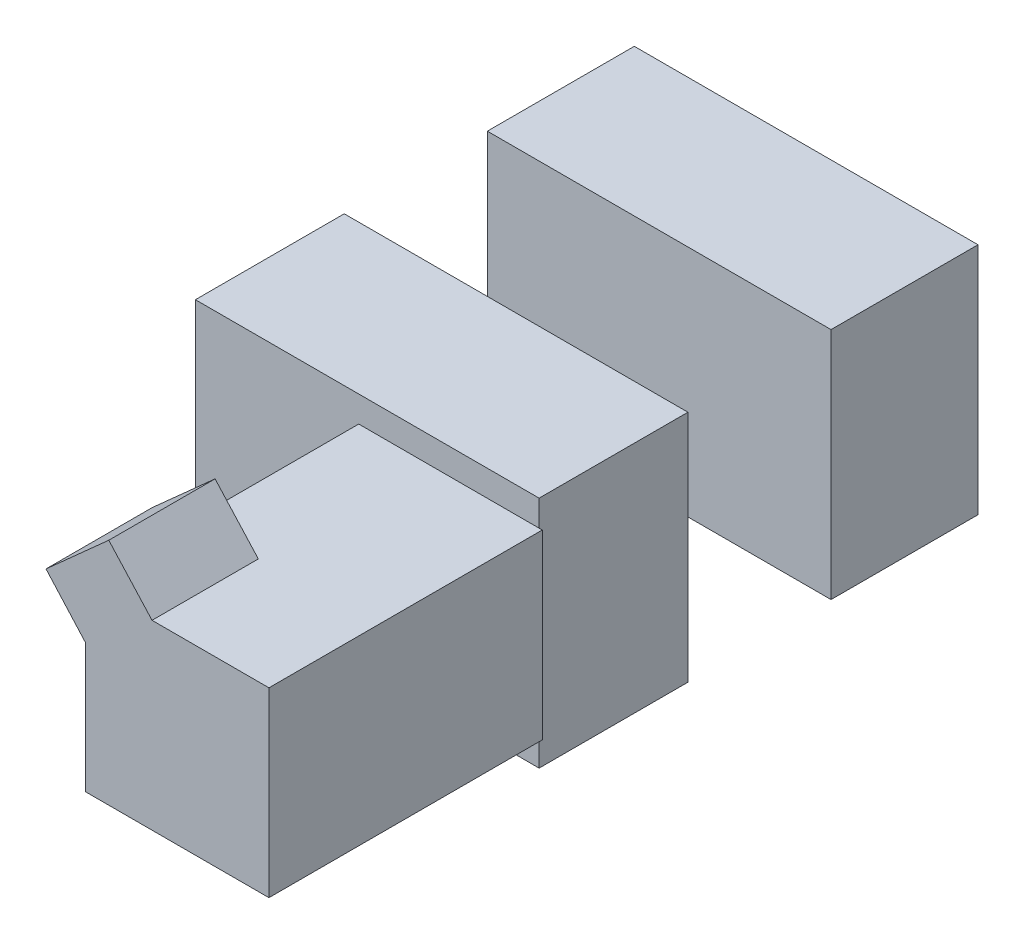
ISO-10303-21;
HEADER;
FILE_DESCRIPTION(('STEP AP214'),'2;1');
FILE_NAME('part.step','',(''),(''),'','','');
FILE_SCHEMA(('AUTOMOTIVE_DESIGN { 1 0 10303 214 1 1 1 1 }'));
ENDSEC;
DATA;
#1=APPLICATION_CONTEXT('core data for automotive mechanical design processes');
#2=APPLICATION_PROTOCOL_DEFINITION('international standard','automotive_design',2000,#1);
#3=PRODUCT_CONTEXT('',#1,'mechanical');
#4=PRODUCT('Part','Part','',(#3));
#5=PRODUCT_RELATED_PRODUCT_CATEGORY('part','',(#4));
#6=PRODUCT_DEFINITION_FORMATION('','',#4);
#7=PRODUCT_DEFINITION_CONTEXT('part definition',#1,'design');
#8=PRODUCT_DEFINITION('design','',#6,#7);
#9=PRODUCT_DEFINITION_SHAPE('','',#8);
#10=(LENGTH_UNIT() NAMED_UNIT(*) SI_UNIT(.MILLI.,.METRE.));
#11=(NAMED_UNIT(*) PLANE_ANGLE_UNIT() SI_UNIT($,.RADIAN.));
#12=(NAMED_UNIT(*) SI_UNIT($,.STERADIAN.) SOLID_ANGLE_UNIT());
#13=UNCERTAINTY_MEASURE_WITH_UNIT(LENGTH_MEASURE(1.E-05),#10,'distance_accuracy_value','');
#14=(GEOMETRIC_REPRESENTATION_CONTEXT(3) GLOBAL_UNCERTAINTY_ASSIGNED_CONTEXT((#13)) GLOBAL_UNIT_ASSIGNED_CONTEXT((#10,
#11,#12)) REPRESENTATION_CONTEXT('',''));
#15=CARTESIAN_POINT('',(0.,0.,0.));
#16=DIRECTION('',(0.,0.,1.));
#17=DIRECTION('',(1.,0.,0.));
#18=AXIS2_PLACEMENT_3D('',#15,#16,#17);
#19=CARTESIAN_POINT('',(0.0291843141343055,0.0385,0.0724133068580298));
#20=DIRECTION('',(0.,0.,-1.));
#21=DIRECTION('',(-1.,0.,0.));
#22=AXIS2_PLACEMENT_3D('',#19,#20,#21);
#23=PLANE('',#22);
#24=DIRECTION('',(1.,0.,0.));
#25=VECTOR('',#24,1.);
#26=CARTESIAN_POINT('',(-0.0302175356821504,-0.0299286581575871,0.0724133068580298));
#27=LINE('',#26,#25);
#28=CARTESIAN_POINT('',(-0.0302175356821504,-0.0299286581575871,0.0724133068580298));
#29=VERTEX_POINT('',#28);
#30=CARTESIAN_POINT('',(0.0291843141343055,-0.0299286581575871,0.0724133068580298));
#31=VERTEX_POINT('',#30);
#32=EDGE_CURVE('E74',#29,#31,#27,.T.);
#33=ORIENTED_EDGE('',*,*,#32,.F.);
#34=DIRECTION('',(0.,-1.,0.));
#35=VECTOR('',#34,1.);
#36=CARTESIAN_POINT('',(-0.0302175356821504,-0.0299286581575871,0.0724133068580298));
#37=LINE('',#36,#35);
#38=CARTESIAN_POINT('',(-0.0302175356821504,0.0299286581575871,0.0724133068580298));
#39=VERTEX_POINT('',#38);
#40=EDGE_CURVE('E200',#39,#29,#37,.T.);
#41=ORIENTED_EDGE('',*,*,#40,.F.);
#42=DIRECTION('',(-1.,0.,0.));
#43=VECTOR('',#42,1.);
#44=CARTESIAN_POINT('',(-0.0302175356821504,0.0299286581575871,0.0724133068580298));
#45=LINE('',#44,#43);
#46=CARTESIAN_POINT('',(0.0291843141343055,0.0299286581575871,0.0724133068580298));
#47=VERTEX_POINT('',#46);
#48=EDGE_CURVE('E59',#47,#39,#45,.T.);
#49=ORIENTED_EDGE('',*,*,#48,.F.);
#50=DIRECTION('',(0.,-1.,0.));
#51=VECTOR('',#50,1.);
#52=CARTESIAN_POINT('',(0.0291843141343055,0.0385,0.0724133068580298));
#53=LINE('',#52,#51);
#54=CARTESIAN_POINT('',(0.0291843141343055,0.0385,0.0724133068580298));
#55=VERTEX_POINT('',#54);
#56=EDGE_CURVE('E224',#55,#47,#53,.T.);
#57=ORIENTED_EDGE('',*,*,#56,.F.);
#58=DIRECTION('',(1.,0.,0.));
#59=VECTOR('',#58,1.);
#60=CARTESIAN_POINT('',(0.0291843141343055,0.0385,0.0724133068580298));
#61=LINE('',#60,#59);
#62=CARTESIAN_POINT('',(-0.083993136882782,0.0385,0.0724133068580298));
#63=VERTEX_POINT('',#62);
#64=EDGE_CURVE('E227',#63,#55,#61,.T.);
#65=ORIENTED_EDGE('',*,*,#64,.F.);
#66=DIRECTION('',(0.,-1.,0.));
#67=VECTOR('',#66,1.);
#68=CARTESIAN_POINT('',(-0.083993136882782,0.0385,0.0724133068580298));
#69=LINE('',#68,#67);
#70=CARTESIAN_POINT('',(-0.083993136882782,-0.0385,0.0724133068580298));
#71=VERTEX_POINT('',#70);
#72=EDGE_CURVE('E220',#63,#71,#69,.T.);
#73=ORIENTED_EDGE('',*,*,#72,.T.);
#74=DIRECTION('',(1.,0.,0.));
#75=VECTOR('',#74,1.);
#76=CARTESIAN_POINT('',(0.0291843141343055,-0.0385,0.0724133068580298));
#77=LINE('',#76,#75);
#78=CARTESIAN_POINT('',(0.0291843141343055,-0.0385,0.0724133068580298));
#79=VERTEX_POINT('',#78);
#80=EDGE_CURVE('E229',#71,#79,#77,.T.);
#81=ORIENTED_EDGE('',*,*,#80,.T.);
#82=EDGE_CURVE('E223',#31,#79,#53,.T.);
#83=ORIENTED_EDGE('',*,*,#82,.F.);
#84=EDGE_LOOP('',(#33,#41,#49,#57,#65,#73,#81,#83));
#85=FACE_BOUND('',#84,.T.);
#86=ADVANCED_FACE('F51',(#85),#23,.F.);
#87=CARTESIAN_POINT('',(0.0291843141343055,0.0385,0.0724133068580298));
#88=DIRECTION('',(-1.,0.,0.));
#89=DIRECTION('',(0.,0.,1.));
#90=AXIS2_PLACEMENT_3D('',#87,#88,#89);
#91=PLANE('',#90);
#92=DIRECTION('',(0.,0.,-1.));
#93=VECTOR('',#92,1.);
#94=CARTESIAN_POINT('',(0.0291843141343055,-0.0385,0.0724133068580298));
#95=LINE('',#94,#93);
#96=CARTESIAN_POINT('',(0.0291843141343055,-0.0385,0.0234103265722403));
#97=VERTEX_POINT('',#96);
#98=EDGE_CURVE('E237',#79,#97,#95,.T.);
#99=ORIENTED_EDGE('',*,*,#98,.T.);
#100=DIRECTION('',(0.,-1.,0.));
#101=VECTOR('',#100,1.);
#102=CARTESIAN_POINT('',(0.0291843141343055,0.0385,0.0234103265722403));
#103=LINE('',#102,#101);
#104=CARTESIAN_POINT('',(0.0291843141343055,0.0385,0.0234103265722403));
#105=VERTEX_POINT('',#104);
#106=EDGE_CURVE('E214',#105,#97,#103,.T.);
#107=ORIENTED_EDGE('',*,*,#106,.F.);
#108=DIRECTION('',(0.,0.,-1.));
#109=VECTOR('',#108,1.);
#110=CARTESIAN_POINT('',(0.0291843141343055,0.0385,0.0724133068580298));
#111=LINE('',#110,#109);
#112=EDGE_CURVE('E233',#55,#105,#111,.T.);
#113=ORIENTED_EDGE('',*,*,#112,.F.);
#114=ORIENTED_EDGE('',*,*,#56,.T.);
#115=EDGE_CURVE('E228',#47,#31,#53,.T.);
#116=ORIENTED_EDGE('',*,*,#115,.T.);
#117=ORIENTED_EDGE('',*,*,#82,.T.);
#118=EDGE_LOOP('',(#99,#107,#113,#114,#116,#117));
#119=FACE_BOUND('',#118,.T.);
#120=ADVANCED_FACE('F252',(#119),#91,.F.);
#121=CARTESIAN_POINT('',(0.0291843141343055,0.0385,0.0234103265722403));
#122=DIRECTION('',(0.,0.,1.));
#123=DIRECTION('',(1.,0.,0.));
#124=AXIS2_PLACEMENT_3D('',#121,#122,#123);
#125=PLANE('',#124);
#126=DIRECTION('',(-1.,0.,0.));
#127=VECTOR('',#126,1.);
#128=CARTESIAN_POINT('',(0.0291843141343055,-0.0385,0.0234103265722403));
#129=LINE('',#128,#127);
#130=CARTESIAN_POINT('',(-0.083993136882782,-0.0385,0.0234103265722403));
#131=VERTEX_POINT('',#130);
#132=EDGE_CURVE('E235',#97,#131,#129,.T.);
#133=ORIENTED_EDGE('',*,*,#132,.T.);
#134=DIRECTION('',(0.,-1.,0.));
#135=VECTOR('',#134,1.);
#136=CARTESIAN_POINT('',(-0.083993136882782,0.0385,0.0234103265722403));
#137=LINE('',#136,#135);
#138=CARTESIAN_POINT('',(-0.083993136882782,0.0385,0.0234103265722403));
#139=VERTEX_POINT('',#138);
#140=EDGE_CURVE('E217',#139,#131,#137,.T.);
#141=ORIENTED_EDGE('',*,*,#140,.F.);
#142=DIRECTION('',(-1.,0.,0.));
#143=VECTOR('',#142,1.);
#144=CARTESIAN_POINT('',(0.0291843141343055,0.0385,0.0234103265722403));
#145=LINE('',#144,#143);
#146=EDGE_CURVE('E243',#105,#139,#145,.T.);
#147=ORIENTED_EDGE('',*,*,#146,.F.);
#148=ORIENTED_EDGE('',*,*,#106,.T.);
#149=EDGE_LOOP('',(#133,#141,#147,#148));
#150=FACE_BOUND('',#149,.T.);
#151=ADVANCED_FACE('F255',(#150),#125,.F.);
#152=CARTESIAN_POINT('',(-0.083993136882782,0.0385,0.0724133068580298));
#153=DIRECTION('',(1.,0.,0.));
#154=DIRECTION('',(0.,0.,-1.));
#155=AXIS2_PLACEMENT_3D('',#152,#153,#154);
#156=PLANE('',#155);
#157=DIRECTION('',(0.,0.,1.));
#158=VECTOR('',#157,1.);
#159=CARTESIAN_POINT('',(-0.083993136882782,-0.0385,0.0724133068580298));
#160=LINE('',#159,#158);
#161=EDGE_CURVE('E232',#131,#71,#160,.T.);
#162=ORIENTED_EDGE('',*,*,#161,.T.);
#163=ORIENTED_EDGE('',*,*,#72,.F.);
#164=DIRECTION('',(0.,0.,1.));
#165=VECTOR('',#164,1.);
#166=CARTESIAN_POINT('',(-0.083993136882782,0.0385,0.0724133068580298));
#167=LINE('',#166,#165);
#168=EDGE_CURVE('E241',#139,#63,#167,.T.);
#169=ORIENTED_EDGE('',*,*,#168,.F.);
#170=ORIENTED_EDGE('',*,*,#140,.T.);
#171=EDGE_LOOP('',(#162,#163,#169,#170));
#172=FACE_BOUND('',#171,.T.);
#173=ADVANCED_FACE('F260',(#172),#156,.F.);
#174=CARTESIAN_POINT('',(0.,0.0385,0.));
#175=DIRECTION('',(0.,1.,0.));
#176=DIRECTION('',(0.,0.,1.));
#177=AXIS2_PLACEMENT_3D('',#174,#175,#176);
#178=PLANE('',#177);
#179=ORIENTED_EDGE('',*,*,#112,.T.);
#180=ORIENTED_EDGE('',*,*,#146,.T.);
#181=ORIENTED_EDGE('',*,*,#168,.T.);
#182=ORIENTED_EDGE('',*,*,#64,.T.);
#183=EDGE_LOOP('',(#179,#180,#181,#182));
#184=FACE_BOUND('',#183,.T.);
#185=ADVANCED_FACE('F53',(#184),#178,.T.);
#186=CARTESIAN_POINT('',(0.,-0.0385,0.));
#187=DIRECTION('',(0.,1.,0.));
#188=DIRECTION('',(0.,0.,1.));
#189=AXIS2_PLACEMENT_3D('',#186,#187,#188);
#190=PLANE('',#189);
#191=ORIENTED_EDGE('',*,*,#98,.F.);
#192=ORIENTED_EDGE('',*,*,#80,.F.);
#193=ORIENTED_EDGE('',*,*,#161,.F.);
#194=ORIENTED_EDGE('',*,*,#132,.F.);
#195=EDGE_LOOP('',(#191,#192,#193,#194));
#196=FACE_BOUND('',#195,.T.);
#197=ADVANCED_FACE('F306',(#196),#190,.F.);
#198=CARTESIAN_POINT('',(0.,0.,0.0724133068580298));
#199=DIRECTION('',(0.,0.,-1.));
#200=DIRECTION('',(-1.,0.,0.));
#201=AXIS2_PLACEMENT_3D('',#198,#199,#200);
#202=PLANE('',#201);
#203=ORIENTED_EDGE('',*,*,#115,.F.);
#204=CARTESIAN_POINT('',(0.0302175356821504,0.0299286581575871,0.0724133068580298));
#205=VERTEX_POINT('',#204);
#206=EDGE_CURVE('E197',#205,#47,#45,.T.);
#207=ORIENTED_EDGE('',*,*,#206,.F.);
#208=DIRECTION('',(0.,1.,0.));
#209=VECTOR('',#208,1.);
#210=CARTESIAN_POINT('',(0.0302175356821504,-0.0299286581575871,0.0724133068580298));
#211=LINE('',#210,#209);
#212=CARTESIAN_POINT('',(0.0302175356821504,-0.0299286581575871,0.0724133068580298));
#213=VERTEX_POINT('',#212);
#214=EDGE_CURVE('E183',#213,#205,#211,.T.);
#215=ORIENTED_EDGE('',*,*,#214,.F.);
#216=EDGE_CURVE('E202',#31,#213,#27,.T.);
#217=ORIENTED_EDGE('',*,*,#216,.F.);
#218=EDGE_LOOP('',(#203,#207,#215,#217));
#219=FACE_BOUND('',#218,.T.);
#220=ADVANCED_FACE('F267',(#219),#202,.T.);
#221=CARTESIAN_POINT('',(0.0302175356821504,-0.0299286581575871,0.16241330685803));
#222=DIRECTION('',(-1.,0.,0.));
#223=DIRECTION('',(0.,0.,1.));
#224=AXIS2_PLACEMENT_3D('',#221,#222,#223);
#225=PLANE('',#224);
#226=ORIENTED_EDGE('',*,*,#214,.T.);
#227=DIRECTION('',(0.,0.,-1.));
#228=VECTOR('',#227,1.);
#229=CARTESIAN_POINT('',(0.0302175356821504,0.0299286581575871,0.16241330685803));
#230=LINE('',#229,#228);
#231=CARTESIAN_POINT('',(0.0302175356821504,0.0299286581575871,0.16241330685803));
#232=VERTEX_POINT('',#231);
#233=EDGE_CURVE('E211',#232,#205,#230,.T.);
#234=ORIENTED_EDGE('',*,*,#233,.F.);
#235=DIRECTION('',(0.,1.,0.));
#236=VECTOR('',#235,1.);
#237=CARTESIAN_POINT('',(0.0302175356821504,-0.0299286581575871,0.16241330685803));
#238=LINE('',#237,#236);
#239=CARTESIAN_POINT('',(0.0302175356821504,-0.0299286581575871,0.16241330685803));
#240=VERTEX_POINT('',#239);
#241=EDGE_CURVE('E184',#240,#232,#238,.T.);
#242=ORIENTED_EDGE('',*,*,#241,.F.);
#243=DIRECTION('',(0.,0.,-1.));
#244=VECTOR('',#243,1.);
#245=CARTESIAN_POINT('',(0.0302175356821504,-0.0299286581575871,0.16241330685803));
#246=LINE('',#245,#244);
#247=EDGE_CURVE('E194',#240,#213,#246,.T.);
#248=ORIENTED_EDGE('',*,*,#247,.T.);
#249=EDGE_LOOP('',(#226,#234,#242,#248));
#250=FACE_BOUND('',#249,.T.);
#251=ADVANCED_FACE('F275',(#250),#225,.F.);
#252=CARTESIAN_POINT('',(-0.0302175356821504,0.0299286581575871,0.16241330685803));
#253=DIRECTION('',(0.,-1.,0.));
#254=DIRECTION('',(0.,0.,-1.));
#255=AXIS2_PLACEMENT_3D('',#252,#253,#254);
#256=PLANE('',#255);
#257=DIRECTION('',(1.,0.,0.));
#258=VECTOR('',#257,1.);
#259=CARTESIAN_POINT('',(-0.0302175356821504,0.0299286581575871,0.12741330685803));
#260=LINE('',#259,#258);
#261=CARTESIAN_POINT('',(-0.0302175356821504,0.0299286581575871,0.12741330685803));
#262=VERTEX_POINT('',#261);
#263=CARTESIAN_POINT('',(-0.00827703686071198,0.0299286581575871,0.12741330685803));
#264=VERTEX_POINT('',#263);
#265=EDGE_CURVE('E181',#262,#264,#260,.T.);
#266=ORIENTED_EDGE('',*,*,#265,.T.);
#267=DIRECTION('',(0.,0.,1.));
#268=VECTOR('',#267,1.);
#269=CARTESIAN_POINT('',(-0.00827703686071198,0.0299286581575871,0.16241330685803));
#270=LINE('',#269,#268);
#271=CARTESIAN_POINT('',(-0.00827703686071198,0.0299286581575871,0.16241330685803));
#272=VERTEX_POINT('',#271);
#273=EDGE_CURVE('E154',#264,#272,#270,.T.);
#274=ORIENTED_EDGE('',*,*,#273,.T.);
#275=DIRECTION('',(-1.,0.,0.));
#276=VECTOR('',#275,1.);
#277=CARTESIAN_POINT('',(-0.0302175356821504,0.0299286581575871,0.16241330685803));
#278=LINE('',#277,#276);
#279=EDGE_CURVE('E187',#232,#272,#278,.T.);
#280=ORIENTED_EDGE('',*,*,#279,.F.);
#281=ORIENTED_EDGE('',*,*,#233,.T.);
#282=ORIENTED_EDGE('',*,*,#206,.T.);
#283=ORIENTED_EDGE('',*,*,#48,.T.);
#284=DIRECTION('',(0.,0.,-1.));
#285=VECTOR('',#284,1.);
#286=CARTESIAN_POINT('',(-0.0302175356821504,0.0299286581575871,0.16241330685803));
#287=LINE('',#286,#285);
#288=EDGE_CURVE('E209',#262,#39,#287,.T.);
#289=ORIENTED_EDGE('',*,*,#288,.F.);
#290=EDGE_LOOP('',(#266,#274,#280,#281,#282,#283,#289));
#291=FACE_BOUND('',#290,.T.);
#292=ADVANCED_FACE('F270',(#291),#256,.F.);
#293=CARTESIAN_POINT('',(-0.0302175356821504,-0.0299286581575871,0.16241330685803));
#294=DIRECTION('',(1.,0.,0.));
#295=DIRECTION('',(0.,0.,-1.));
#296=AXIS2_PLACEMENT_3D('',#293,#294,#295);
#297=PLANE('',#296);
#298=DIRECTION('',(0.,-1.,0.));
#299=VECTOR('',#298,1.);
#300=CARTESIAN_POINT('',(-0.0302175356821504,-0.0299286581575871,0.16241330685803));
#301=LINE('',#300,#299);
#302=CARTESIAN_POINT('',(-0.0302175356821504,0.0126365309997264,0.16241330685803));
#303=VERTEX_POINT('',#302);
#304=CARTESIAN_POINT('',(-0.0302175356821504,-0.0299286581575871,0.16241330685803));
#305=VERTEX_POINT('',#304);
#306=EDGE_CURVE('E190',#303,#305,#301,.T.);
#307=ORIENTED_EDGE('',*,*,#306,.F.);
#308=DIRECTION('',(0.,0.,1.));
#309=VECTOR('',#308,1.);
#310=CARTESIAN_POINT('',(-0.0302175356821504,0.0126365309997264,0.12741330685803));
#311=LINE('',#310,#309);
#312=CARTESIAN_POINT('',(-0.0302175356821504,0.0126365309997264,0.12741330685803));
#313=VERTEX_POINT('',#312);
#314=EDGE_CURVE('E177',#313,#303,#311,.T.);
#315=ORIENTED_EDGE('',*,*,#314,.F.);
#316=DIRECTION('',(0.,1.,0.));
#317=VECTOR('',#316,1.);
#318=CARTESIAN_POINT('',(-0.0302175356821504,-0.0299286581575871,0.12741330685803));
#319=LINE('',#318,#317);
#320=EDGE_CURVE('E12',#313,#262,#319,.T.);
#321=ORIENTED_EDGE('',*,*,#320,.T.);
#322=ORIENTED_EDGE('',*,*,#288,.T.);
#323=ORIENTED_EDGE('',*,*,#40,.T.);
#324=DIRECTION('',(0.,0.,-1.));
#325=VECTOR('',#324,1.);
#326=CARTESIAN_POINT('',(-0.0302175356821504,-0.0299286581575871,0.16241330685803));
#327=LINE('',#326,#325);
#328=EDGE_CURVE('E206',#305,#29,#327,.T.);
#329=ORIENTED_EDGE('',*,*,#328,.F.);
#330=EDGE_LOOP('',(#307,#315,#321,#322,#323,#329));
#331=FACE_BOUND('',#330,.T.);
#332=ADVANCED_FACE('F283',(#331),#297,.F.);
#333=CARTESIAN_POINT('',(-0.0302175356821504,-0.0299286581575871,0.16241330685803));
#334=DIRECTION('',(0.,1.,0.));
#335=DIRECTION('',(0.,0.,1.));
#336=AXIS2_PLACEMENT_3D('',#333,#334,#335);
#337=PLANE('',#336);
#338=ORIENTED_EDGE('',*,*,#32,.T.);
#339=ORIENTED_EDGE('',*,*,#216,.T.);
#340=ORIENTED_EDGE('',*,*,#247,.F.);
#341=DIRECTION('',(1.,0.,0.));
#342=VECTOR('',#341,1.);
#343=CARTESIAN_POINT('',(-0.0302175356821504,-0.0299286581575871,0.16241330685803));
#344=LINE('',#343,#342);
#345=EDGE_CURVE('E192',#305,#240,#344,.T.);
#346=ORIENTED_EDGE('',*,*,#345,.F.);
#347=ORIENTED_EDGE('',*,*,#328,.T.);
#348=EDGE_LOOP('',(#338,#339,#340,#346,#347));
#349=FACE_BOUND('',#348,.T.);
#350=ADVANCED_FACE('F279',(#349),#337,.F.);
#351=CARTESIAN_POINT('',(0.,0.,0.16241330685803));
#352=DIRECTION('',(0.,0.,-1.));
#353=DIRECTION('',(-1.,0.,0.));
#354=AXIS2_PLACEMENT_3D('',#351,#352,#353);
#355=PLANE('',#354);
#356=ORIENTED_EDGE('',*,*,#279,.T.);
#357=DIRECTION('',(-0.671637135183694,0.740880259314716,0.));
#358=VECTOR('',#357,1.);
#359=CARTESIAN_POINT('',(-0.0225220918268375,0.0456423217780016,0.16241330685803));
#360=LINE('',#359,#358);
#361=CARTESIAN_POINT('',(-0.0225220918268375,0.0456423217780016,0.16241330685803));
#362=VERTEX_POINT('',#361);
#363=EDGE_CURVE('E173',#272,#362,#360,.T.);
#364=ORIENTED_EDGE('',*,*,#363,.T.);
#365=DIRECTION('',(-0.7449244789865,-0.667148799449337,0.));
#366=VECTOR('',#365,1.);
#367=CARTESIAN_POINT('',(-0.0431954581019835,0.0271274093538523,0.16241330685803));
#368=LINE('',#367,#366);
#369=CARTESIAN_POINT('',(-0.0431954581019835,0.0271274093538523,0.16241330685803));
#370=VERTEX_POINT('',#369);
#371=EDGE_CURVE('E164',#362,#370,#368,.T.);
#372=ORIENTED_EDGE('',*,*,#371,.T.);
#373=DIRECTION('',(0.667148799449337,-0.7449244789865,0.));
#374=VECTOR('',#373,1.);
#375=CARTESIAN_POINT('',(-0.0302175356821504,0.0126365309997264,0.16241330685803));
#376=LINE('',#375,#374);
#377=EDGE_CURVE('E66',#370,#303,#376,.T.);
#378=ORIENTED_EDGE('',*,*,#377,.T.);
#379=ORIENTED_EDGE('',*,*,#306,.T.);
#380=ORIENTED_EDGE('',*,*,#345,.T.);
#381=ORIENTED_EDGE('',*,*,#241,.T.);
#382=EDGE_LOOP('',(#356,#364,#372,#378,#379,#380,#381));
#383=FACE_BOUND('',#382,.T.);
#384=ADVANCED_FACE('F287',(#383),#355,.F.);
#385=CARTESIAN_POINT('',(0.,0.,0.12741330685803));
#386=DIRECTION('',(0.,0.,-1.));
#387=DIRECTION('',(-1.,0.,0.));
#388=AXIS2_PLACEMENT_3D('',#385,#386,#387);
#389=PLANE('',#388);
#390=ORIENTED_EDGE('',*,*,#265,.F.);
#391=ORIENTED_EDGE('',*,*,#320,.F.);
#392=DIRECTION('',(0.667148799449337,-0.7449244789865,0.));
#393=VECTOR('',#392,1.);
#394=CARTESIAN_POINT('',(-0.0302175356821504,0.0126365309997264,0.12741330685803));
#395=LINE('',#394,#393);
#396=CARTESIAN_POINT('',(-0.0431954581019835,0.0271274093538523,0.12741330685803));
#397=VERTEX_POINT('',#396);
#398=EDGE_CURVE('E166',#397,#313,#395,.T.);
#399=ORIENTED_EDGE('',*,*,#398,.F.);
#400=DIRECTION('',(-0.7449244789865,-0.667148799449337,0.));
#401=VECTOR('',#400,1.);
#402=CARTESIAN_POINT('',(-0.0431954581019835,0.0271274093538523,0.12741330685803));
#403=LINE('',#402,#401);
#404=CARTESIAN_POINT('',(-0.0225220918268375,0.0456423217780016,0.12741330685803));
#405=VERTEX_POINT('',#404);
#406=EDGE_CURVE('E158',#405,#397,#403,.T.);
#407=ORIENTED_EDGE('',*,*,#406,.F.);
#408=DIRECTION('',(-0.671637135183694,0.740880259314716,0.));
#409=VECTOR('',#408,1.);
#410=CARTESIAN_POINT('',(-0.0225220918268375,0.0456423217780016,0.12741330685803));
#411=LINE('',#410,#409);
#412=EDGE_CURVE('E148',#264,#405,#411,.T.);
#413=ORIENTED_EDGE('',*,*,#412,.F.);
#414=EDGE_LOOP('',(#390,#391,#399,#407,#413));
#415=FACE_BOUND('',#414,.T.);
#416=ADVANCED_FACE('F168',(#415),#389,.T.);
#417=CARTESIAN_POINT('',(-0.0225220918268375,0.0456423217780016,0.12741330685803));
#418=DIRECTION('',(0.740880259314716,0.671637135183694,0.));
#419=DIRECTION('',(-0.671637135183694,0.740880259314716,0.));
#420=AXIS2_PLACEMENT_3D('',#417,#418,#419);
#421=PLANE('',#420);
#422=ORIENTED_EDGE('',*,*,#273,.F.);
#423=ORIENTED_EDGE('',*,*,#412,.T.);
#424=DIRECTION('',(0.,0.,1.));
#425=VECTOR('',#424,1.);
#426=CARTESIAN_POINT('',(-0.0225220918268375,0.0456423217780016,0.12741330685803));
#427=LINE('',#426,#425);
#428=EDGE_CURVE('E151',#405,#362,#427,.T.);
#429=ORIENTED_EDGE('',*,*,#428,.T.);
#430=ORIENTED_EDGE('',*,*,#363,.F.);
#431=EDGE_LOOP('',(#422,#423,#429,#430));
#432=FACE_BOUND('',#431,.T.);
#433=ADVANCED_FACE('F150',(#432),#421,.T.);
#434=CARTESIAN_POINT('',(-0.0302175356821504,0.0126365309997264,0.12741330685803));
#435=DIRECTION('',(-0.7449244789865,-0.667148799449337,0.));
#436=DIRECTION('',(0.667148799449337,-0.7449244789865,0.));
#437=AXIS2_PLACEMENT_3D('',#434,#435,#436);
#438=PLANE('',#437);
#439=ORIENTED_EDGE('',*,*,#377,.F.);
#440=DIRECTION('',(0.,0.,1.));
#441=VECTOR('',#440,1.);
#442=CARTESIAN_POINT('',(-0.0431954581019835,0.0271274093538523,0.12741330685803));
#443=LINE('',#442,#441);
#444=EDGE_CURVE('E165',#397,#370,#443,.T.);
#445=ORIENTED_EDGE('',*,*,#444,.F.);
#446=ORIENTED_EDGE('',*,*,#398,.T.);
#447=ORIENTED_EDGE('',*,*,#314,.T.);
#448=EDGE_LOOP('',(#439,#445,#446,#447));
#449=FACE_BOUND('',#448,.T.);
#450=ADVANCED_FACE('F286',(#449),#438,.T.);
#451=CARTESIAN_POINT('',(-0.0431954581019835,0.0271274093538523,0.12741330685803));
#452=DIRECTION('',(-0.667148799449337,0.7449244789865,0.));
#453=DIRECTION('',(-0.7449244789865,-0.667148799449337,0.));
#454=AXIS2_PLACEMENT_3D('',#451,#452,#453);
#455=PLANE('',#454);
#456=ORIENTED_EDGE('',*,*,#371,.F.);
#457=ORIENTED_EDGE('',*,*,#428,.F.);
#458=ORIENTED_EDGE('',*,*,#406,.T.);
#459=ORIENTED_EDGE('',*,*,#444,.T.);
#460=EDGE_LOOP('',(#456,#457,#458,#459));
#461=FACE_BOUND('',#460,.T.);
#462=ADVANCED_FACE('F162',(#461),#455,.T.);
#463=CLOSED_SHELL('',(#86,#120,#151,#173,#185,#197,#220,#251,#292,#332,#350,#384,#416,#433,#450,#462));
#464=MANIFOLD_SOLID_BREP('B2',#463);
#465=CARTESIAN_POINT('',(-0.083993136882782,0.0385,-0.0721080005168915));
#466=DIRECTION('',(1.,0.,0.));
#467=DIRECTION('',(0.,0.,-1.));
#468=AXIS2_PLACEMENT_3D('',#465,#466,#467);
#469=PLANE('',#468);
#470=DIRECTION('',(0.,0.,1.));
#471=VECTOR('',#470,1.);
#472=CARTESIAN_POINT('',(-0.083993136882782,-0.0385,-0.0721080005168915));
#473=LINE('',#472,#471);
#474=CARTESIAN_POINT('',(-0.083993136882782,-0.0385,-0.0721080005168915));
#475=VERTEX_POINT('',#474);
#476=CARTESIAN_POINT('',(-0.083993136882782,-0.0385,-0.0237159438302637));
#477=VERTEX_POINT('',#476);
#478=EDGE_CURVE('E517',#475,#477,#473,.T.);
#479=ORIENTED_EDGE('',*,*,#478,.T.);
#480=DIRECTION('',(0.,-1.,0.));
#481=VECTOR('',#480,1.);
#482=CARTESIAN_POINT('',(-0.083993136882782,0.0385,-0.0237159438302637));
#483=LINE('',#482,#481);
#484=CARTESIAN_POINT('',(-0.083993136882782,0.0385,-0.0237159438302637));
#485=VERTEX_POINT('',#484);
#486=EDGE_CURVE('E49',#485,#477,#483,.T.);
#487=ORIENTED_EDGE('',*,*,#486,.F.);
#488=DIRECTION('',(0.,0.,1.));
#489=VECTOR('',#488,1.);
#490=CARTESIAN_POINT('',(-0.083993136882782,0.0385,-0.0721080005168915));
#491=LINE('',#490,#489);
#492=CARTESIAN_POINT('',(-0.083993136882782,0.0385,-0.0721080005168915));
#493=VERTEX_POINT('',#492);
#494=EDGE_CURVE('E505',#493,#485,#491,.T.);
#495=ORIENTED_EDGE('',*,*,#494,.F.);
#496=DIRECTION('',(0.,-1.,0.));
#497=VECTOR('',#496,1.);
#498=CARTESIAN_POINT('',(-0.083993136882782,0.0385,-0.0721080005168915));
#499=LINE('',#498,#497);
#500=EDGE_CURVE('E513',#493,#475,#499,.T.);
#501=ORIENTED_EDGE('',*,*,#500,.T.);
#502=EDGE_LOOP('',(#479,#487,#495,#501));
#503=FACE_BOUND('',#502,.T.);
#504=ADVANCED_FACE('F454',(#503),#469,.F.);
#505=CARTESIAN_POINT('',(-0.083993136882782,0.0385,-0.0237159438302637));
#506=DIRECTION('',(0.,0.,-1.));
#507=DIRECTION('',(-1.,0.,0.));
#508=AXIS2_PLACEMENT_3D('',#505,#506,#507);
#509=PLANE('',#508);
#510=DIRECTION('',(1.,0.,0.));
#511=VECTOR('',#510,1.);
#512=CARTESIAN_POINT('',(-0.083993136882782,-0.0385,-0.0237159438302637));
#513=LINE('',#512,#511);
#514=CARTESIAN_POINT('',(0.0291843141343055,-0.0385,-0.0237159438302637));
#515=VERTEX_POINT('',#514);
#516=EDGE_CURVE('E509',#477,#515,#513,.T.);
#517=ORIENTED_EDGE('',*,*,#516,.T.);
#518=DIRECTION('',(0.,-1.,0.));
#519=VECTOR('',#518,1.);
#520=CARTESIAN_POINT('',(0.0291843141343055,0.0385,-0.0237159438302637));
#521=LINE('',#520,#519);
#522=CARTESIAN_POINT('',(0.0291843141343055,0.0385,-0.0237159438302637));
#523=VERTEX_POINT('',#522);
#524=EDGE_CURVE('E462',#523,#515,#521,.T.);
#525=ORIENTED_EDGE('',*,*,#524,.F.);
#526=DIRECTION('',(1.,0.,0.));
#527=VECTOR('',#526,1.);
#528=CARTESIAN_POINT('',(-0.083993136882782,0.0385,-0.0237159438302637));
#529=LINE('',#528,#527);
#530=EDGE_CURVE('E500',#485,#523,#529,.T.);
#531=ORIENTED_EDGE('',*,*,#530,.F.);
#532=ORIENTED_EDGE('',*,*,#486,.T.);
#533=EDGE_LOOP('',(#517,#525,#531,#532));
#534=FACE_BOUND('',#533,.T.);
#535=ADVANCED_FACE('F508',(#534),#509,.F.);
#536=CARTESIAN_POINT('',(0.0291843141343055,0.0385,-0.0721080005168915));
#537=DIRECTION('',(-1.,0.,0.));
#538=DIRECTION('',(0.,0.,1.));
#539=AXIS2_PLACEMENT_3D('',#536,#537,#538);
#540=PLANE('',#539);
#541=DIRECTION('',(0.,0.,-1.));
#542=VECTOR('',#541,1.);
#543=CARTESIAN_POINT('',(0.0291843141343055,-0.0385,-0.0721080005168915));
#544=LINE('',#543,#542);
#545=CARTESIAN_POINT('',(0.0291843141343055,-0.0385,-0.0721080005168915));
#546=VERTEX_POINT('',#545);
#547=EDGE_CURVE('E487',#515,#546,#544,.T.);
#548=ORIENTED_EDGE('',*,*,#547,.T.);
#549=DIRECTION('',(0.,-1.,0.));
#550=VECTOR('',#549,1.);
#551=CARTESIAN_POINT('',(0.0291843141343055,0.0385,-0.0721080005168915));
#552=LINE('',#551,#550);
#553=CARTESIAN_POINT('',(0.0291843141343055,0.0385,-0.0721080005168915));
#554=VERTEX_POINT('',#553);
#555=EDGE_CURVE('E510',#554,#546,#552,.T.);
#556=ORIENTED_EDGE('',*,*,#555,.F.);
#557=DIRECTION('',(0.,0.,-1.));
#558=VECTOR('',#557,1.);
#559=CARTESIAN_POINT('',(0.0291843141343055,0.0385,-0.0721080005168915));
#560=LINE('',#559,#558);
#561=EDGE_CURVE('E503',#523,#554,#560,.T.);
#562=ORIENTED_EDGE('',*,*,#561,.F.);
#563=ORIENTED_EDGE('',*,*,#524,.T.);
#564=EDGE_LOOP('',(#548,#556,#562,#563));
#565=FACE_BOUND('',#564,.T.);
#566=ADVANCED_FACE('F511',(#565),#540,.F.);
#567=CARTESIAN_POINT('',(-0.083993136882782,0.0385,-0.0721080005168915));
#568=DIRECTION('',(0.,0.,1.));
#569=DIRECTION('',(1.,0.,0.));
#570=AXIS2_PLACEMENT_3D('',#567,#568,#569);
#571=PLANE('',#570);
#572=DIRECTION('',(-1.,0.,0.));
#573=VECTOR('',#572,1.);
#574=CARTESIAN_POINT('',(-0.083993136882782,-0.0385,-0.0721080005168915));
#575=LINE('',#574,#573);
#576=EDGE_CURVE('E493',#546,#475,#575,.T.);
#577=ORIENTED_EDGE('',*,*,#576,.T.);
#578=ORIENTED_EDGE('',*,*,#500,.F.);
#579=DIRECTION('',(-1.,0.,0.));
#580=VECTOR('',#579,1.);
#581=CARTESIAN_POINT('',(-0.083993136882782,0.0385,-0.0721080005168915));
#582=LINE('',#581,#580);
#583=EDGE_CURVE('E470',#554,#493,#582,.T.);
#584=ORIENTED_EDGE('',*,*,#583,.F.);
#585=ORIENTED_EDGE('',*,*,#555,.T.);
#586=EDGE_LOOP('',(#577,#578,#584,#585));
#587=FACE_BOUND('',#586,.T.);
#588=ADVANCED_FACE('F524',(#587),#571,.F.);
#589=CARTESIAN_POINT('',(0.,0.0385,0.));
#590=DIRECTION('',(0.,1.,0.));
#591=DIRECTION('',(0.,0.,1.));
#592=AXIS2_PLACEMENT_3D('',#589,#590,#591);
#593=PLANE('',#592);
#594=ORIENTED_EDGE('',*,*,#494,.T.);
#595=ORIENTED_EDGE('',*,*,#530,.T.);
#596=ORIENTED_EDGE('',*,*,#561,.T.);
#597=ORIENTED_EDGE('',*,*,#583,.T.);
#598=EDGE_LOOP('',(#594,#595,#596,#597));
#599=FACE_BOUND('',#598,.T.);
#600=ADVANCED_FACE('F501',(#599),#593,.T.);
#601=CARTESIAN_POINT('',(0.,-0.0385,0.));
#602=DIRECTION('',(0.,1.,0.));
#603=DIRECTION('',(0.,0.,1.));
#604=AXIS2_PLACEMENT_3D('',#601,#602,#603);
#605=PLANE('',#604);
#606=ORIENTED_EDGE('',*,*,#478,.F.);
#607=ORIENTED_EDGE('',*,*,#576,.F.);
#608=ORIENTED_EDGE('',*,*,#547,.F.);
#609=ORIENTED_EDGE('',*,*,#516,.F.);
#610=EDGE_LOOP('',(#606,#607,#608,#609));
#611=FACE_BOUND('',#610,.T.);
#612=ADVANCED_FACE('F527',(#611),#605,.F.);
#613=CLOSED_SHELL('',(#504,#535,#566,#588,#600,#612));
#614=MANIFOLD_SOLID_BREP('B6',#613);
#615=ADVANCED_BREP_SHAPE_REPRESENTATION('',(#18,#464,#614),#14);
#616=SHAPE_DEFINITION_REPRESENTATION(#9,#615);
ENDSEC;
END-ISO-10303-21;
